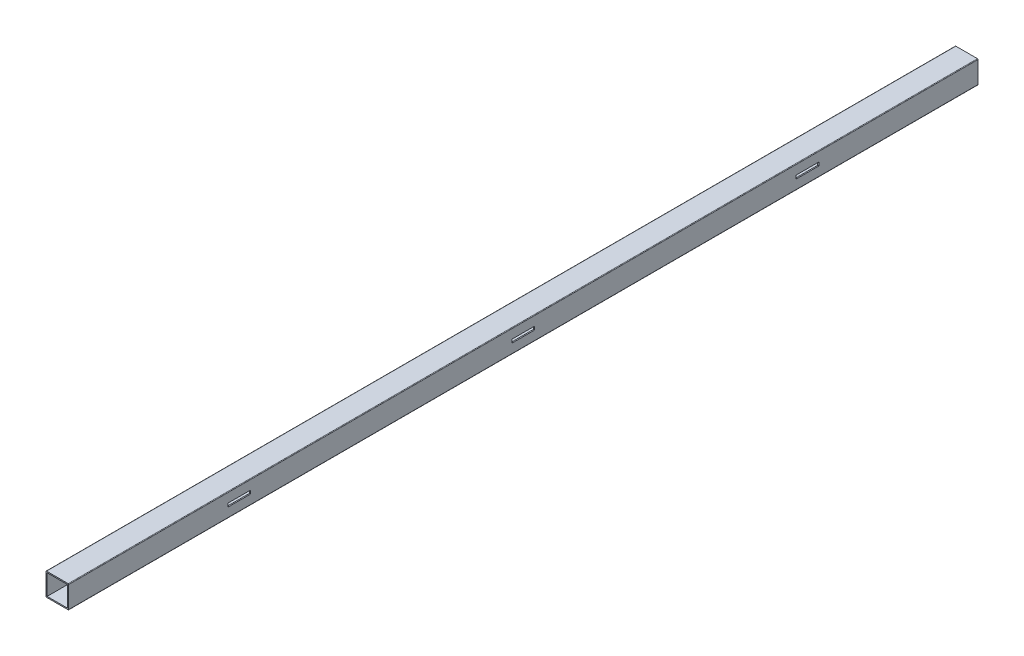
ISO-10303-21;
HEADER;
FILE_DESCRIPTION(('STEP AP214'),'2;1');
FILE_NAME('part.step','',(''),(''),'','','');
FILE_SCHEMA(('AUTOMOTIVE_DESIGN { 1 0 10303 214 1 1 1 1 }'));
ENDSEC;
DATA;
#1=APPLICATION_CONTEXT('core data for automotive mechanical design processes');
#2=APPLICATION_PROTOCOL_DEFINITION('international standard','automotive_design',2000,#1);
#3=PRODUCT_CONTEXT('',#1,'mechanical');
#4=PRODUCT('Part','Part','',(#3));
#5=PRODUCT_RELATED_PRODUCT_CATEGORY('part','',(#4));
#6=PRODUCT_DEFINITION_FORMATION('','',#4);
#7=PRODUCT_DEFINITION_CONTEXT('part definition',#1,'design');
#8=PRODUCT_DEFINITION('design','',#6,#7);
#9=PRODUCT_DEFINITION_SHAPE('','',#8);
#10=(LENGTH_UNIT() NAMED_UNIT(*) SI_UNIT(.MILLI.,.METRE.));
#11=(NAMED_UNIT(*) PLANE_ANGLE_UNIT() SI_UNIT($,.RADIAN.));
#12=(NAMED_UNIT(*) SI_UNIT($,.STERADIAN.) SOLID_ANGLE_UNIT());
#13=UNCERTAINTY_MEASURE_WITH_UNIT(LENGTH_MEASURE(1.E-05),#10,'distance_accuracy_value','');
#14=(GEOMETRIC_REPRESENTATION_CONTEXT(3) GLOBAL_UNCERTAINTY_ASSIGNED_CONTEXT((#13)) GLOBAL_UNIT_ASSIGNED_CONTEXT((#10,
#11,#12)) REPRESENTATION_CONTEXT('',''));
#15=CARTESIAN_POINT('',(0.,0.,0.));
#16=DIRECTION('',(0.,0.,1.));
#17=DIRECTION('',(1.,0.,0.));
#18=AXIS2_PLACEMENT_3D('',#15,#16,#17);
#19=CARTESIAN_POINT('',(-9.5,-9.5,800.));
#20=DIRECTION('',(0.,0.,1.));
#21=DIRECTION('',(1.,0.,0.));
#22=AXIS2_PLACEMENT_3D('',#19,#20,#21);
#23=PLANE('',#22);
#24=CARTESIAN_POINT('',(-9.5,-9.5,800.));
#25=DIRECTION('',(0.,0.,1.));
#26=DIRECTION('',(-1.,0.,0.));
#27=AXIS2_PLACEMENT_3D('',#24,#25,#26);
#28=CIRCLE('',#27,0.5);
#29=CARTESIAN_POINT('',(-10.,-9.49999999999999,800.));
#30=VERTEX_POINT('',#29);
#31=CARTESIAN_POINT('',(-9.49999999999999,-10.,800.));
#32=VERTEX_POINT('',#31);
#33=EDGE_CURVE('E334',#30,#32,#28,.T.);
#34=ORIENTED_EDGE('',*,*,#33,.T.);
#35=DIRECTION('',(1.,0.,0.));
#36=VECTOR('',#35,1.);
#37=CARTESIAN_POINT('',(-9.49999999999999,-10.,800.));
#38=LINE('',#37,#36);
#39=CARTESIAN_POINT('',(9.5,-10.,800.));
#40=VERTEX_POINT('',#39);
#41=EDGE_CURVE('E337',#32,#40,#38,.T.);
#42=ORIENTED_EDGE('',*,*,#41,.T.);
#43=CARTESIAN_POINT('',(9.5,-9.5,800.));
#44=DIRECTION('',(0.,0.,1.));
#45=DIRECTION('',(1.,0.,0.));
#46=AXIS2_PLACEMENT_3D('',#43,#44,#45);
#47=CIRCLE('',#46,0.5);
#48=CARTESIAN_POINT('',(10.,-9.5,800.));
#49=VERTEX_POINT('',#48);
#50=EDGE_CURVE('E340',#40,#49,#47,.T.);
#51=ORIENTED_EDGE('',*,*,#50,.T.);
#52=DIRECTION('',(0.,1.,0.));
#53=VECTOR('',#52,1.);
#54=CARTESIAN_POINT('',(10.,-9.49999999999999,800.));
#55=LINE('',#54,#53);
#56=CARTESIAN_POINT('',(10.,9.5,800.));
#57=VERTEX_POINT('',#56);
#58=EDGE_CURVE('E342',#49,#57,#55,.T.);
#59=ORIENTED_EDGE('',*,*,#58,.T.);
#60=CARTESIAN_POINT('',(9.5,9.5,800.));
#61=DIRECTION('',(0.,0.,1.));
#62=DIRECTION('',(-1.,0.,0.));
#63=AXIS2_PLACEMENT_3D('',#60,#61,#62);
#64=CIRCLE('',#63,0.5);
#65=CARTESIAN_POINT('',(9.5,10.,800.));
#66=VERTEX_POINT('',#65);
#67=EDGE_CURVE('E344',#57,#66,#64,.T.);
#68=ORIENTED_EDGE('',*,*,#67,.T.);
#69=DIRECTION('',(-1.,0.,0.));
#70=VECTOR('',#69,1.);
#71=CARTESIAN_POINT('',(-9.49999999999999,10.,800.));
#72=LINE('',#71,#70);
#73=CARTESIAN_POINT('',(-9.49999999999999,10.,800.));
#74=VERTEX_POINT('',#73);
#75=EDGE_CURVE('E346',#66,#74,#72,.T.);
#76=ORIENTED_EDGE('',*,*,#75,.T.);
#77=CARTESIAN_POINT('',(-9.5,9.5,800.));
#78=DIRECTION('',(0.,0.,1.));
#79=DIRECTION('',(-1.,0.,0.));
#80=AXIS2_PLACEMENT_3D('',#77,#78,#79);
#81=CIRCLE('',#80,0.5);
#82=CARTESIAN_POINT('',(-10.,9.5,800.));
#83=VERTEX_POINT('',#82);
#84=EDGE_CURVE('E348',#74,#83,#81,.T.);
#85=ORIENTED_EDGE('',*,*,#84,.T.);
#86=DIRECTION('',(0.,-1.,0.));
#87=VECTOR('',#86,1.);
#88=CARTESIAN_POINT('',(-10.,-9.49999999999999,800.));
#89=LINE('',#88,#87);
#90=EDGE_CURVE('E350',#83,#30,#89,.T.);
#91=ORIENTED_EDGE('',*,*,#90,.T.);
#92=EDGE_LOOP('',(#34,#42,#51,#59,#68,#76,#85,#91));
#93=FACE_BOUND('',#92,.T.);
#94=DIRECTION('',(1.,0.,0.));
#95=VECTOR('',#94,1.);
#96=CARTESIAN_POINT('',(-9.5,-9.,800.));
#97=LINE('',#96,#95);
#98=CARTESIAN_POINT('',(-9.,-9.,800.));
#99=VERTEX_POINT('',#98);
#100=CARTESIAN_POINT('',(9.,-9.,800.));
#101=VERTEX_POINT('',#100);
#102=EDGE_CURVE('E305',#99,#101,#97,.T.);
#103=ORIENTED_EDGE('',*,*,#102,.F.);
#104=DIRECTION('',(0.,-1.,0.));
#105=VECTOR('',#104,1.);
#106=CARTESIAN_POINT('',(-9.,-9.5,800.));
#107=LINE('',#106,#105);
#108=CARTESIAN_POINT('',(-9.,9.,800.));
#109=VERTEX_POINT('',#108);
#110=EDGE_CURVE('E303',#109,#99,#107,.T.);
#111=ORIENTED_EDGE('',*,*,#110,.F.);
#112=DIRECTION('',(-1.,0.,0.));
#113=VECTOR('',#112,1.);
#114=CARTESIAN_POINT('',(-9.5,9.,800.));
#115=LINE('',#114,#113);
#116=CARTESIAN_POINT('',(9.,9.,800.));
#117=VERTEX_POINT('',#116);
#118=EDGE_CURVE('E311',#117,#109,#115,.T.);
#119=ORIENTED_EDGE('',*,*,#118,.F.);
#120=DIRECTION('',(0.,1.,0.));
#121=VECTOR('',#120,1.);
#122=CARTESIAN_POINT('',(9.,-9.5,800.));
#123=LINE('',#122,#121);
#124=EDGE_CURVE('E308',#101,#117,#123,.T.);
#125=ORIENTED_EDGE('',*,*,#124,.F.);
#126=EDGE_LOOP('',(#103,#111,#119,#125));
#127=FACE_BOUND('',#126,.T.);
#128=ADVANCED_FACE('F69',(#93,#127),#23,.T.);
#129=CARTESIAN_POINT('',(-9.5,-9.5,0.));
#130=DIRECTION('',(0.,0.,1.));
#131=DIRECTION('',(1.,0.,0.));
#132=AXIS2_PLACEMENT_3D('',#129,#130,#131);
#133=PLANE('',#132);
#134=CARTESIAN_POINT('',(-9.5,-9.5,0.));
#135=DIRECTION('',(0.,0.,1.));
#136=DIRECTION('',(-1.,0.,0.));
#137=AXIS2_PLACEMENT_3D('',#134,#135,#136);
#138=CIRCLE('',#137,0.5);
#139=CARTESIAN_POINT('',(-10.,-9.49999999999999,0.));
#140=VERTEX_POINT('',#139);
#141=CARTESIAN_POINT('',(-9.49999999999999,-10.,0.));
#142=VERTEX_POINT('',#141);
#143=EDGE_CURVE('E333',#140,#142,#138,.T.);
#144=ORIENTED_EDGE('',*,*,#143,.F.);
#145=DIRECTION('',(0.,-1.,0.));
#146=VECTOR('',#145,1.);
#147=CARTESIAN_POINT('',(-10.,-9.49999999999999,0.));
#148=LINE('',#147,#146);
#149=CARTESIAN_POINT('',(-10.,9.5,0.));
#150=VERTEX_POINT('',#149);
#151=EDGE_CURVE('E338',#150,#140,#148,.T.);
#152=ORIENTED_EDGE('',*,*,#151,.F.);
#153=CARTESIAN_POINT('',(-9.5,9.5,0.));
#154=DIRECTION('',(0.,0.,1.));
#155=DIRECTION('',(-1.,0.,0.));
#156=AXIS2_PLACEMENT_3D('',#153,#154,#155);
#157=CIRCLE('',#156,0.5);
#158=CARTESIAN_POINT('',(-9.49999999999999,10.,0.));
#159=VERTEX_POINT('',#158);
#160=EDGE_CURVE('E365',#159,#150,#157,.T.);
#161=ORIENTED_EDGE('',*,*,#160,.F.);
#162=DIRECTION('',(-1.,0.,0.));
#163=VECTOR('',#162,1.);
#164=CARTESIAN_POINT('',(-9.49999999999999,10.,0.));
#165=LINE('',#164,#163);
#166=CARTESIAN_POINT('',(9.5,10.,0.));
#167=VERTEX_POINT('',#166);
#168=EDGE_CURVE('E363',#167,#159,#165,.T.);
#169=ORIENTED_EDGE('',*,*,#168,.F.);
#170=CARTESIAN_POINT('',(9.5,9.5,0.));
#171=DIRECTION('',(0.,0.,1.));
#172=DIRECTION('',(-1.,0.,0.));
#173=AXIS2_PLACEMENT_3D('',#170,#171,#172);
#174=CIRCLE('',#173,0.5);
#175=CARTESIAN_POINT('',(10.,9.5,0.));
#176=VERTEX_POINT('',#175);
#177=EDGE_CURVE('E361',#176,#167,#174,.T.);
#178=ORIENTED_EDGE('',*,*,#177,.F.);
#179=DIRECTION('',(0.,1.,0.));
#180=VECTOR('',#179,1.);
#181=CARTESIAN_POINT('',(10.,-9.49999999999999,0.));
#182=LINE('',#181,#180);
#183=CARTESIAN_POINT('',(10.,-9.5,0.));
#184=VERTEX_POINT('',#183);
#185=EDGE_CURVE('E359',#184,#176,#182,.T.);
#186=ORIENTED_EDGE('',*,*,#185,.F.);
#187=CARTESIAN_POINT('',(9.5,-9.5,0.));
#188=DIRECTION('',(0.,0.,1.));
#189=DIRECTION('',(1.,0.,0.));
#190=AXIS2_PLACEMENT_3D('',#187,#188,#189);
#191=CIRCLE('',#190,0.5);
#192=CARTESIAN_POINT('',(9.5,-10.,0.));
#193=VERTEX_POINT('',#192);
#194=EDGE_CURVE('E357',#193,#184,#191,.T.);
#195=ORIENTED_EDGE('',*,*,#194,.F.);
#196=DIRECTION('',(1.,0.,0.));
#197=VECTOR('',#196,1.);
#198=CARTESIAN_POINT('',(-9.49999999999999,-10.,0.));
#199=LINE('',#198,#197);
#200=EDGE_CURVE('E355',#142,#193,#199,.T.);
#201=ORIENTED_EDGE('',*,*,#200,.F.);
#202=EDGE_LOOP('',(#144,#152,#161,#169,#178,#186,#195,#201));
#203=FACE_BOUND('',#202,.T.);
#204=DIRECTION('',(0.,-1.,0.));
#205=VECTOR('',#204,1.);
#206=CARTESIAN_POINT('',(-9.,-9.5,0.));
#207=LINE('',#206,#205);
#208=CARTESIAN_POINT('',(-9.,9.,0.));
#209=VERTEX_POINT('',#208);
#210=CARTESIAN_POINT('',(-9.,-9.,0.));
#211=VERTEX_POINT('',#210);
#212=EDGE_CURVE('E262',#209,#211,#207,.T.);
#213=ORIENTED_EDGE('',*,*,#212,.T.);
#214=DIRECTION('',(1.,0.,0.));
#215=VECTOR('',#214,1.);
#216=CARTESIAN_POINT('',(-9.5,-9.,0.));
#217=LINE('',#216,#215);
#218=CARTESIAN_POINT('',(9.,-9.,0.));
#219=VERTEX_POINT('',#218);
#220=EDGE_CURVE('E316',#211,#219,#217,.T.);
#221=ORIENTED_EDGE('',*,*,#220,.T.);
#222=DIRECTION('',(0.,1.,0.));
#223=VECTOR('',#222,1.);
#224=CARTESIAN_POINT('',(9.,-9.5,0.));
#225=LINE('',#224,#223);
#226=CARTESIAN_POINT('',(9.,9.,0.));
#227=VERTEX_POINT('',#226);
#228=EDGE_CURVE('E319',#219,#227,#225,.T.);
#229=ORIENTED_EDGE('',*,*,#228,.T.);
#230=DIRECTION('',(-1.,0.,0.));
#231=VECTOR('',#230,1.);
#232=CARTESIAN_POINT('',(-9.5,9.,0.));
#233=LINE('',#232,#231);
#234=EDGE_CURVE('E306',#227,#209,#233,.T.);
#235=ORIENTED_EDGE('',*,*,#234,.T.);
#236=EDGE_LOOP('',(#213,#221,#229,#235));
#237=FACE_BOUND('',#236,.T.);
#238=ADVANCED_FACE('F448',(#203,#237),#133,.F.);
#239=CARTESIAN_POINT('',(-9.5,-9.5,800.));
#240=DIRECTION('',(0.,0.,-1.));
#241=DIRECTION('',(-1.,0.,0.));
#242=AXIS2_PLACEMENT_3D('',#239,#240,#241);
#243=CYLINDRICAL_SURFACE('',#242,0.5);
#244=ORIENTED_EDGE('',*,*,#143,.T.);
#245=DIRECTION('',(0.,0.,-1.));
#246=VECTOR('',#245,1.);
#247=CARTESIAN_POINT('',(-9.49999999999999,-10.,800.));
#248=LINE('',#247,#246);
#249=EDGE_CURVE('E388',#32,#142,#248,.T.);
#250=ORIENTED_EDGE('',*,*,#249,.F.);
#251=ORIENTED_EDGE('',*,*,#33,.F.);
#252=DIRECTION('',(0.,0.,-1.));
#253=VECTOR('',#252,1.);
#254=CARTESIAN_POINT('',(-10.,-9.49999999999999,800.));
#255=LINE('',#254,#253);
#256=EDGE_CURVE('E352',#30,#140,#255,.T.);
#257=ORIENTED_EDGE('',*,*,#256,.T.);
#258=EDGE_LOOP('',(#244,#250,#251,#257));
#259=FACE_BOUND('',#258,.T.);
#260=ADVANCED_FACE('F71',(#259),#243,.T.);
#261=CARTESIAN_POINT('',(-9.49999999999999,-10.,800.));
#262=DIRECTION('',(0.,1.,0.));
#263=DIRECTION('',(0.,0.,1.));
#264=AXIS2_PLACEMENT_3D('',#261,#262,#263);
#265=PLANE('',#264);
#266=CARTESIAN_POINT('',(0.,-10.,25.));
#267=DIRECTION('',(0.,-1.,0.));
#268=DIRECTION('',(0.,0.,-1.));
#269=AXIS2_PLACEMENT_3D('',#266,#267,#268);
#270=CIRCLE('',#269,2.5);
#271=CARTESIAN_POINT('',(0.,-10.,22.5));
#272=VERTEX_POINT('',#271);
#273=EDGE_CURVE('E417',#272,#272,#270,.T.);
#274=ORIENTED_EDGE('',*,*,#273,.F.);
#275=EDGE_LOOP('',(#274));
#276=FACE_BOUND('',#275,.T.);
#277=CARTESIAN_POINT('',(-8.57562249721442E-13,-10.,275.));
#278=DIRECTION('',(0.,-1.,0.));
#279=DIRECTION('',(0.,0.,-1.));
#280=AXIS2_PLACEMENT_3D('',#277,#278,#279);
#281=CIRCLE('',#280,2.5);
#282=CARTESIAN_POINT('',(-8.57562249721442E-13,-10.,272.5));
#283=VERTEX_POINT('',#282);
#284=EDGE_CURVE('E510',#283,#283,#281,.T.);
#285=ORIENTED_EDGE('',*,*,#284,.F.);
#286=EDGE_LOOP('',(#285));
#287=FACE_BOUND('',#286,.T.);
#288=CARTESIAN_POINT('',(-1.71512449944288E-12,-10.,525.));
#289=DIRECTION('',(0.,-1.,0.));
#290=DIRECTION('',(0.,0.,-1.));
#291=AXIS2_PLACEMENT_3D('',#288,#289,#290);
#292=CIRCLE('',#291,2.5);
#293=CARTESIAN_POINT('',(-1.71512449944288E-12,-10.,522.5));
#294=VERTEX_POINT('',#293);
#295=EDGE_CURVE('E514',#294,#294,#292,.T.);
#296=ORIENTED_EDGE('',*,*,#295,.F.);
#297=EDGE_LOOP('',(#296));
#298=FACE_BOUND('',#297,.T.);
#299=CARTESIAN_POINT('',(-1.33779710956545E-12,-10.,775.));
#300=DIRECTION('',(0.,-1.,0.));
#301=DIRECTION('',(0.,0.,-1.));
#302=AXIS2_PLACEMENT_3D('',#299,#300,#301);
#303=CIRCLE('',#302,2.5);
#304=CARTESIAN_POINT('',(-1.33779710956545E-12,-10.,772.5));
#305=VERTEX_POINT('',#304);
#306=EDGE_CURVE('E518',#305,#305,#303,.T.);
#307=ORIENTED_EDGE('',*,*,#306,.F.);
#308=EDGE_LOOP('',(#307));
#309=FACE_BOUND('',#308,.T.);
#310=ORIENTED_EDGE('',*,*,#200,.T.);
#311=DIRECTION('',(0.,0.,-1.));
#312=VECTOR('',#311,1.);
#313=CARTESIAN_POINT('',(9.5,-10.,800.));
#314=LINE('',#313,#312);
#315=EDGE_CURVE('E385',#40,#193,#314,.T.);
#316=ORIENTED_EDGE('',*,*,#315,.F.);
#317=ORIENTED_EDGE('',*,*,#41,.F.);
#318=ORIENTED_EDGE('',*,*,#249,.T.);
#319=EDGE_LOOP('',(#310,#316,#317,#318));
#320=FACE_BOUND('',#319,.T.);
#321=ADVANCED_FACE('F496',(#276,#287,#298,#309,#320),#265,.F.);
#322=CARTESIAN_POINT('',(9.5,-9.5,800.));
#323=DIRECTION('',(0.,0.,-1.));
#324=DIRECTION('',(-1.,0.,0.));
#325=AXIS2_PLACEMENT_3D('',#322,#323,#324);
#326=CYLINDRICAL_SURFACE('',#325,0.5);
#327=ORIENTED_EDGE('',*,*,#194,.T.);
#328=DIRECTION('',(0.,0.,-1.));
#329=VECTOR('',#328,1.);
#330=CARTESIAN_POINT('',(10.,-9.5,800.));
#331=LINE('',#330,#329);
#332=EDGE_CURVE('E382',#49,#184,#331,.T.);
#333=ORIENTED_EDGE('',*,*,#332,.F.);
#334=ORIENTED_EDGE('',*,*,#50,.F.);
#335=ORIENTED_EDGE('',*,*,#315,.T.);
#336=EDGE_LOOP('',(#327,#333,#334,#335));
#337=FACE_BOUND('',#336,.T.);
#338=ADVANCED_FACE('F494',(#337),#326,.T.);
#339=CARTESIAN_POINT('',(10.,-9.49999999999999,800.));
#340=DIRECTION('',(-1.,0.,0.));
#341=DIRECTION('',(0.,0.,1.));
#342=AXIS2_PLACEMENT_3D('',#339,#340,#341);
#343=PLANE('',#342);
#344=DIRECTION('',(0.,0.,-1.));
#345=VECTOR('',#344,1.);
#346=CARTESIAN_POINT('',(10.,-1.5,140.));
#347=LINE('',#346,#345);
#348=CARTESIAN_POINT('',(10.,-1.5,160.));
#349=VERTEX_POINT('',#348);
#350=CARTESIAN_POINT('',(10.,-1.5,140.));
#351=VERTEX_POINT('',#350);
#352=EDGE_CURVE('E248',#349,#351,#347,.T.);
#353=ORIENTED_EDGE('',*,*,#352,.F.);
#354=DIRECTION('',(0.,-1.,0.));
#355=VECTOR('',#354,1.);
#356=CARTESIAN_POINT('',(10.,-1.5,160.));
#357=LINE('',#356,#355);
#358=CARTESIAN_POINT('',(10.,1.5,160.));
#359=VERTEX_POINT('',#358);
#360=EDGE_CURVE('E86',#359,#349,#357,.T.);
#361=ORIENTED_EDGE('',*,*,#360,.F.);
#362=DIRECTION('',(0.,0.,1.));
#363=VECTOR('',#362,1.);
#364=CARTESIAN_POINT('',(10.,1.5,140.));
#365=LINE('',#364,#363);
#366=CARTESIAN_POINT('',(10.,1.5,140.));
#367=VERTEX_POINT('',#366);
#368=EDGE_CURVE('E255',#367,#359,#365,.T.);
#369=ORIENTED_EDGE('',*,*,#368,.F.);
#370=DIRECTION('',(0.,1.,0.));
#371=VECTOR('',#370,1.);
#372=CARTESIAN_POINT('',(10.,-1.5,140.));
#373=LINE('',#372,#371);
#374=EDGE_CURVE('E238',#351,#367,#373,.T.);
#375=ORIENTED_EDGE('',*,*,#374,.F.);
#376=EDGE_LOOP('',(#353,#361,#369,#375));
#377=FACE_BOUND('',#376,.T.);
#378=DIRECTION('',(0.,-1.,0.));
#379=VECTOR('',#378,1.);
#380=CARTESIAN_POINT('',(10.,-1.50000000000175,410.));
#381=LINE('',#380,#379);
#382=CARTESIAN_POINT('',(10.,1.49999999999825,410.));
#383=VERTEX_POINT('',#382);
#384=CARTESIAN_POINT('',(10.,-1.50000000000175,410.));
#385=VERTEX_POINT('',#384);
#386=EDGE_CURVE('E266',#383,#385,#381,.T.);
#387=ORIENTED_EDGE('',*,*,#386,.F.);
#388=DIRECTION('',(0.,0.,1.));
#389=VECTOR('',#388,1.);
#390=CARTESIAN_POINT('',(10.,1.49999999999826,390.));
#391=LINE('',#390,#389);
#392=CARTESIAN_POINT('',(10.,1.49999999999826,390.));
#393=VERTEX_POINT('',#392);
#394=EDGE_CURVE('E94',#393,#383,#391,.T.);
#395=ORIENTED_EDGE('',*,*,#394,.F.);
#396=DIRECTION('',(0.,1.,0.));
#397=VECTOR('',#396,1.);
#398=CARTESIAN_POINT('',(10.,-1.50000000000174,390.));
#399=LINE('',#398,#397);
#400=CARTESIAN_POINT('',(10.,-1.50000000000174,390.));
#401=VERTEX_POINT('',#400);
#402=EDGE_CURVE('E273',#401,#393,#399,.T.);
#403=ORIENTED_EDGE('',*,*,#402,.F.);
#404=DIRECTION('',(0.,0.,-1.));
#405=VECTOR('',#404,1.);
#406=CARTESIAN_POINT('',(10.,-1.50000000000174,390.));
#407=LINE('',#406,#405);
#408=EDGE_CURVE('E270',#385,#401,#407,.T.);
#409=ORIENTED_EDGE('',*,*,#408,.F.);
#410=EDGE_LOOP('',(#387,#395,#403,#409));
#411=FACE_BOUND('',#410,.T.);
#412=DIRECTION('',(0.,-1.,0.));
#413=VECTOR('',#412,1.);
#414=CARTESIAN_POINT('',(10.,-1.50000000000342,660.));
#415=LINE('',#414,#413);
#416=CARTESIAN_POINT('',(10.,1.49999999999658,660.));
#417=VERTEX_POINT('',#416);
#418=CARTESIAN_POINT('',(10.,-1.50000000000342,660.));
#419=VERTEX_POINT('',#418);
#420=EDGE_CURVE('E286',#417,#419,#415,.T.);
#421=ORIENTED_EDGE('',*,*,#420,.F.);
#422=DIRECTION('',(0.,0.,1.));
#423=VECTOR('',#422,1.);
#424=CARTESIAN_POINT('',(10.,1.49999999999651,640.));
#425=LINE('',#424,#423);
#426=CARTESIAN_POINT('',(10.,1.49999999999651,640.));
#427=VERTEX_POINT('',#426);
#428=EDGE_CURVE('E284',#427,#417,#425,.T.);
#429=ORIENTED_EDGE('',*,*,#428,.F.);
#430=DIRECTION('',(0.,1.,0.));
#431=VECTOR('',#430,1.);
#432=CARTESIAN_POINT('',(10.,-1.50000000000349,640.));
#433=LINE('',#432,#431);
#434=CARTESIAN_POINT('',(10.,-1.50000000000349,640.));
#435=VERTEX_POINT('',#434);
#436=EDGE_CURVE('E292',#435,#427,#433,.T.);
#437=ORIENTED_EDGE('',*,*,#436,.F.);
#438=DIRECTION('',(0.,0.,-1.));
#439=VECTOR('',#438,1.);
#440=CARTESIAN_POINT('',(10.,-1.50000000000349,640.));
#441=LINE('',#440,#439);
#442=EDGE_CURVE('E289',#419,#435,#441,.T.);
#443=ORIENTED_EDGE('',*,*,#442,.F.);
#444=EDGE_LOOP('',(#421,#429,#437,#443));
#445=FACE_BOUND('',#444,.T.);
#446=ORIENTED_EDGE('',*,*,#185,.T.);
#447=DIRECTION('',(0.,0.,-1.));
#448=VECTOR('',#447,1.);
#449=CARTESIAN_POINT('',(10.,9.5,800.));
#450=LINE('',#449,#448);
#451=EDGE_CURVE('E379',#57,#176,#450,.T.);
#452=ORIENTED_EDGE('',*,*,#451,.F.);
#453=ORIENTED_EDGE('',*,*,#58,.F.);
#454=ORIENTED_EDGE('',*,*,#332,.T.);
#455=EDGE_LOOP('',(#446,#452,#453,#454));
#456=FACE_BOUND('',#455,.T.);
#457=ADVANCED_FACE('F252',(#377,#411,#445,#456),#343,.F.);
#458=CARTESIAN_POINT('',(9.5,9.5,800.));
#459=DIRECTION('',(0.,0.,-1.));
#460=DIRECTION('',(-1.,0.,0.));
#461=AXIS2_PLACEMENT_3D('',#458,#459,#460);
#462=CYLINDRICAL_SURFACE('',#461,0.5);
#463=ORIENTED_EDGE('',*,*,#177,.T.);
#464=DIRECTION('',(0.,0.,-1.));
#465=VECTOR('',#464,1.);
#466=CARTESIAN_POINT('',(9.5,10.,800.));
#467=LINE('',#466,#465);
#468=EDGE_CURVE('E376',#66,#167,#467,.T.);
#469=ORIENTED_EDGE('',*,*,#468,.F.);
#470=ORIENTED_EDGE('',*,*,#67,.F.);
#471=ORIENTED_EDGE('',*,*,#451,.T.);
#472=EDGE_LOOP('',(#463,#469,#470,#471));
#473=FACE_BOUND('',#472,.T.);
#474=ADVANCED_FACE('F487',(#473),#462,.T.);
#475=CARTESIAN_POINT('',(-9.49999999999999,10.,800.));
#476=DIRECTION('',(0.,-1.,0.));
#477=DIRECTION('',(0.,0.,-1.));
#478=AXIS2_PLACEMENT_3D('',#475,#476,#477);
#479=PLANE('',#478);
#480=ORIENTED_EDGE('',*,*,#168,.T.);
#481=DIRECTION('',(0.,0.,-1.));
#482=VECTOR('',#481,1.);
#483=CARTESIAN_POINT('',(-9.49999999999999,10.,800.));
#484=LINE('',#483,#482);
#485=EDGE_CURVE('E373',#74,#159,#484,.T.);
#486=ORIENTED_EDGE('',*,*,#485,.F.);
#487=ORIENTED_EDGE('',*,*,#75,.F.);
#488=ORIENTED_EDGE('',*,*,#468,.T.);
#489=EDGE_LOOP('',(#480,#486,#487,#488));
#490=FACE_BOUND('',#489,.T.);
#491=ADVANCED_FACE('F483',(#490),#479,.F.);
#492=CARTESIAN_POINT('',(-9.5,9.5,800.));
#493=DIRECTION('',(0.,0.,-1.));
#494=DIRECTION('',(-1.,0.,0.));
#495=AXIS2_PLACEMENT_3D('',#492,#493,#494);
#496=CYLINDRICAL_SURFACE('',#495,0.5);
#497=ORIENTED_EDGE('',*,*,#160,.T.);
#498=DIRECTION('',(0.,0.,-1.));
#499=VECTOR('',#498,1.);
#500=CARTESIAN_POINT('',(-10.,9.5,800.));
#501=LINE('',#500,#499);
#502=EDGE_CURVE('E370',#83,#150,#501,.T.);
#503=ORIENTED_EDGE('',*,*,#502,.F.);
#504=ORIENTED_EDGE('',*,*,#84,.F.);
#505=ORIENTED_EDGE('',*,*,#485,.T.);
#506=EDGE_LOOP('',(#497,#503,#504,#505));
#507=FACE_BOUND('',#506,.T.);
#508=ADVANCED_FACE('F479',(#507),#496,.T.);
#509=CARTESIAN_POINT('',(-10.,-9.49999999999999,800.));
#510=DIRECTION('',(1.,0.,0.));
#511=DIRECTION('',(0.,0.,-1.));
#512=AXIS2_PLACEMENT_3D('',#509,#510,#511);
#513=PLANE('',#512);
#514=ORIENTED_EDGE('',*,*,#151,.T.);
#515=ORIENTED_EDGE('',*,*,#256,.F.);
#516=ORIENTED_EDGE('',*,*,#90,.F.);
#517=ORIENTED_EDGE('',*,*,#502,.T.);
#518=EDGE_LOOP('',(#514,#515,#516,#517));
#519=FACE_BOUND('',#518,.T.);
#520=ADVANCED_FACE('F476',(#519),#513,.F.);
#521=CARTESIAN_POINT('',(-9.,-9.5,800.));
#522=DIRECTION('',(1.,0.,0.));
#523=DIRECTION('',(0.,0.,-1.));
#524=AXIS2_PLACEMENT_3D('',#521,#522,#523);
#525=PLANE('',#524);
#526=ORIENTED_EDGE('',*,*,#212,.F.);
#527=DIRECTION('',(0.,0.,-1.));
#528=VECTOR('',#527,1.);
#529=CARTESIAN_POINT('',(-9.,9.,800.));
#530=LINE('',#529,#528);
#531=EDGE_CURVE('E313',#109,#209,#530,.T.);
#532=ORIENTED_EDGE('',*,*,#531,.F.);
#533=ORIENTED_EDGE('',*,*,#110,.T.);
#534=DIRECTION('',(0.,0.,-1.));
#535=VECTOR('',#534,1.);
#536=CARTESIAN_POINT('',(-9.,-9.,800.));
#537=LINE('',#536,#535);
#538=EDGE_CURVE('E330',#99,#211,#537,.T.);
#539=ORIENTED_EDGE('',*,*,#538,.T.);
#540=EDGE_LOOP('',(#526,#532,#533,#539));
#541=FACE_BOUND('',#540,.T.);
#542=ADVANCED_FACE('F433',(#541),#525,.T.);
#543=CARTESIAN_POINT('',(-9.5,-9.,800.));
#544=DIRECTION('',(0.,1.,0.));
#545=DIRECTION('',(0.,0.,1.));
#546=AXIS2_PLACEMENT_3D('',#543,#544,#545);
#547=PLANE('',#546);
#548=CARTESIAN_POINT('',(0.,-9.,25.));
#549=DIRECTION('',(0.,1.,0.));
#550=DIRECTION('',(0.,0.,1.));
#551=AXIS2_PLACEMENT_3D('',#548,#549,#550);
#552=CIRCLE('',#551,2.5);
#553=CARTESIAN_POINT('',(0.,-9.,27.5));
#554=VERTEX_POINT('',#553);
#555=EDGE_CURVE('E73',#554,#554,#552,.T.);
#556=ORIENTED_EDGE('',*,*,#555,.F.);
#557=EDGE_LOOP('',(#556));
#558=FACE_BOUND('',#557,.T.);
#559=CARTESIAN_POINT('',(-8.57562249721442E-13,-9.,275.));
#560=DIRECTION('',(0.,1.,0.));
#561=DIRECTION('',(0.,0.,1.));
#562=AXIS2_PLACEMENT_3D('',#559,#560,#561);
#563=CIRCLE('',#562,2.5);
#564=CARTESIAN_POINT('',(-8.57562249721442E-13,-9.,277.5));
#565=VERTEX_POINT('',#564);
#566=EDGE_CURVE('E419',#565,#565,#563,.T.);
#567=ORIENTED_EDGE('',*,*,#566,.F.);
#568=EDGE_LOOP('',(#567));
#569=FACE_BOUND('',#568,.T.);
#570=CARTESIAN_POINT('',(-1.71512449944288E-12,-9.,525.));
#571=DIRECTION('',(0.,1.,0.));
#572=DIRECTION('',(0.,0.,1.));
#573=AXIS2_PLACEMENT_3D('',#570,#571,#572);
#574=CIRCLE('',#573,2.5);
#575=CARTESIAN_POINT('',(-1.71512449944288E-12,-9.,527.5));
#576=VERTEX_POINT('',#575);
#577=EDGE_CURVE('E416',#576,#576,#574,.T.);
#578=ORIENTED_EDGE('',*,*,#577,.F.);
#579=EDGE_LOOP('',(#578));
#580=FACE_BOUND('',#579,.T.);
#581=CARTESIAN_POINT('',(-1.33779710956545E-12,-9.,775.));
#582=DIRECTION('',(0.,1.,0.));
#583=DIRECTION('',(0.,0.,1.));
#584=AXIS2_PLACEMENT_3D('',#581,#582,#583);
#585=CIRCLE('',#584,2.5);
#586=CARTESIAN_POINT('',(-1.33779710956545E-12,-9.,777.5));
#587=VERTEX_POINT('',#586);
#588=EDGE_CURVE('E413',#587,#587,#585,.T.);
#589=ORIENTED_EDGE('',*,*,#588,.F.);
#590=EDGE_LOOP('',(#589));
#591=FACE_BOUND('',#590,.T.);
#592=ORIENTED_EDGE('',*,*,#220,.F.);
#593=ORIENTED_EDGE('',*,*,#538,.F.);
#594=ORIENTED_EDGE('',*,*,#102,.T.);
#595=DIRECTION('',(0.,0.,-1.));
#596=VECTOR('',#595,1.);
#597=CARTESIAN_POINT('',(9.,-9.,800.));
#598=LINE('',#597,#596);
#599=EDGE_CURVE('E328',#101,#219,#598,.T.);
#600=ORIENTED_EDGE('',*,*,#599,.T.);
#601=EDGE_LOOP('',(#592,#593,#594,#600));
#602=FACE_BOUND('',#601,.T.);
#603=ADVANCED_FACE('F429',(#558,#569,#580,#591,#602),#547,.T.);
#604=CARTESIAN_POINT('',(9.,-9.5,800.));
#605=DIRECTION('',(-1.,0.,0.));
#606=DIRECTION('',(0.,0.,1.));
#607=AXIS2_PLACEMENT_3D('',#604,#605,#606);
#608=PLANE('',#607);
#609=DIRECTION('',(0.,1.,0.));
#610=VECTOR('',#609,1.);
#611=CARTESIAN_POINT('',(9.,-9.5,160.));
#612=LINE('',#611,#610);
#613=CARTESIAN_POINT('',(9.,-1.5,160.));
#614=VERTEX_POINT('',#613);
#615=CARTESIAN_POINT('',(9.,1.5,160.));
#616=VERTEX_POINT('',#615);
#617=EDGE_CURVE('E12',#614,#616,#612,.T.);
#618=ORIENTED_EDGE('',*,*,#617,.F.);
#619=DIRECTION('',(0.,0.,1.));
#620=VECTOR('',#619,1.);
#621=CARTESIAN_POINT('',(9.,-1.50000000000011,800.));
#622=LINE('',#621,#620);
#623=CARTESIAN_POINT('',(9.,-1.5,140.));
#624=VERTEX_POINT('',#623);
#625=EDGE_CURVE('E409',#624,#614,#622,.T.);
#626=ORIENTED_EDGE('',*,*,#625,.F.);
#627=DIRECTION('',(0.,-1.,0.));
#628=VECTOR('',#627,1.);
#629=CARTESIAN_POINT('',(9.,-9.5,140.));
#630=LINE('',#629,#628);
#631=CARTESIAN_POINT('',(9.,1.5,140.));
#632=VERTEX_POINT('',#631);
#633=EDGE_CURVE('E241',#632,#624,#630,.T.);
#634=ORIENTED_EDGE('',*,*,#633,.F.);
#635=DIRECTION('',(0.,0.,-1.));
#636=VECTOR('',#635,1.);
#637=CARTESIAN_POINT('',(9.,1.49999999999989,800.));
#638=LINE('',#637,#636);
#639=EDGE_CURVE('E78',#616,#632,#638,.T.);
#640=ORIENTED_EDGE('',*,*,#639,.F.);
#641=EDGE_LOOP('',(#618,#626,#634,#640));
#642=FACE_BOUND('',#641,.T.);
#643=DIRECTION('',(0.,0.,-1.));
#644=VECTOR('',#643,1.);
#645=CARTESIAN_POINT('',(9.,1.49999999999821,800.));
#646=LINE('',#645,#644);
#647=CARTESIAN_POINT('',(9.,1.49999999999825,410.));
#648=VERTEX_POINT('',#647);
#649=CARTESIAN_POINT('',(9.,1.49999999999826,390.));
#650=VERTEX_POINT('',#649);
#651=EDGE_CURVE('E407',#648,#650,#646,.T.);
#652=ORIENTED_EDGE('',*,*,#651,.F.);
#653=DIRECTION('',(0.,1.,0.));
#654=VECTOR('',#653,1.);
#655=CARTESIAN_POINT('',(9.,-9.5,410.));
#656=LINE('',#655,#654);
#657=CARTESIAN_POINT('',(9.,-1.50000000000175,410.));
#658=VERTEX_POINT('',#657);
#659=EDGE_CURVE('E400',#658,#648,#656,.T.);
#660=ORIENTED_EDGE('',*,*,#659,.F.);
#661=DIRECTION('',(0.,0.,1.));
#662=VECTOR('',#661,1.);
#663=CARTESIAN_POINT('',(9.,-1.50000000000179,800.));
#664=LINE('',#663,#662);
#665=CARTESIAN_POINT('',(9.,-1.50000000000174,390.));
#666=VERTEX_POINT('',#665);
#667=EDGE_CURVE('E402',#666,#658,#664,.T.);
#668=ORIENTED_EDGE('',*,*,#667,.F.);
#669=DIRECTION('',(0.,-1.,0.));
#670=VECTOR('',#669,1.);
#671=CARTESIAN_POINT('',(9.,-9.5,390.));
#672=LINE('',#671,#670);
#673=EDGE_CURVE('E405',#650,#666,#672,.T.);
#674=ORIENTED_EDGE('',*,*,#673,.F.);
#675=EDGE_LOOP('',(#652,#660,#668,#674));
#676=FACE_BOUND('',#675,.T.);
#677=DIRECTION('',(0.,0.,-1.));
#678=VECTOR('',#677,1.);
#679=CARTESIAN_POINT('',(9.,1.49999999999705,800.));
#680=LINE('',#679,#678);
#681=CARTESIAN_POINT('',(9.,1.49999999999658,660.));
#682=VERTEX_POINT('',#681);
#683=CARTESIAN_POINT('',(9.,1.49999999999651,640.));
#684=VERTEX_POINT('',#683);
#685=EDGE_CURVE('E398',#682,#684,#680,.T.);
#686=ORIENTED_EDGE('',*,*,#685,.F.);
#687=DIRECTION('',(0.,1.,0.));
#688=VECTOR('',#687,1.);
#689=CARTESIAN_POINT('',(9.,-9.5,660.));
#690=LINE('',#689,#688);
#691=CARTESIAN_POINT('',(9.,-1.50000000000342,660.));
#692=VERTEX_POINT('',#691);
#693=EDGE_CURVE('E391',#692,#682,#690,.T.);
#694=ORIENTED_EDGE('',*,*,#693,.F.);
#695=DIRECTION('',(0.,0.,1.));
#696=VECTOR('',#695,1.);
#697=CARTESIAN_POINT('',(9.,-1.50000000000295,800.));
#698=LINE('',#697,#696);
#699=CARTESIAN_POINT('',(9.,-1.50000000000349,640.));
#700=VERTEX_POINT('',#699);
#701=EDGE_CURVE('E393',#700,#692,#698,.T.);
#702=ORIENTED_EDGE('',*,*,#701,.F.);
#703=DIRECTION('',(0.,-1.,0.));
#704=VECTOR('',#703,1.);
#705=CARTESIAN_POINT('',(9.,-9.5,640.));
#706=LINE('',#705,#704);
#707=EDGE_CURVE('E396',#684,#700,#706,.T.);
#708=ORIENTED_EDGE('',*,*,#707,.F.);
#709=EDGE_LOOP('',(#686,#694,#702,#708));
#710=FACE_BOUND('',#709,.T.);
#711=ORIENTED_EDGE('',*,*,#228,.F.);
#712=ORIENTED_EDGE('',*,*,#599,.F.);
#713=ORIENTED_EDGE('',*,*,#124,.T.);
#714=DIRECTION('',(0.,0.,-1.));
#715=VECTOR('',#714,1.);
#716=CARTESIAN_POINT('',(9.,9.,800.));
#717=LINE('',#716,#715);
#718=EDGE_CURVE('E326',#117,#227,#717,.T.);
#719=ORIENTED_EDGE('',*,*,#718,.T.);
#720=EDGE_LOOP('',(#711,#712,#713,#719));
#721=FACE_BOUND('',#720,.T.);
#722=ADVANCED_FACE('F432',(#642,#676,#710,#721),#608,.T.);
#723=CARTESIAN_POINT('',(-9.5,9.,800.));
#724=DIRECTION('',(0.,-1.,0.));
#725=DIRECTION('',(0.,0.,-1.));
#726=AXIS2_PLACEMENT_3D('',#723,#724,#725);
#727=PLANE('',#726);
#728=ORIENTED_EDGE('',*,*,#234,.F.);
#729=ORIENTED_EDGE('',*,*,#718,.F.);
#730=ORIENTED_EDGE('',*,*,#118,.T.);
#731=ORIENTED_EDGE('',*,*,#531,.T.);
#732=EDGE_LOOP('',(#728,#729,#730,#731));
#733=FACE_BOUND('',#732,.T.);
#734=ADVANCED_FACE('F451',(#733),#727,.T.);
#735=CARTESIAN_POINT('',(0.,1.49999999999651,640.));
#736=DIRECTION('',(0.,1.,0.));
#737=DIRECTION('',(0.,0.,1.));
#738=AXIS2_PLACEMENT_3D('',#735,#736,#737);
#739=PLANE('',#738);
#740=ORIENTED_EDGE('',*,*,#685,.T.);
#741=DIRECTION('',(1.,0.,0.));
#742=VECTOR('',#741,1.);
#743=CARTESIAN_POINT('',(0.,1.49999999999651,640.));
#744=LINE('',#743,#742);
#745=EDGE_CURVE('E267',#684,#427,#744,.T.);
#746=ORIENTED_EDGE('',*,*,#745,.T.);
#747=ORIENTED_EDGE('',*,*,#428,.T.);
#748=DIRECTION('',(1.,0.,0.));
#749=VECTOR('',#748,1.);
#750=CARTESIAN_POINT('',(0.,1.49999999999658,660.));
#751=LINE('',#750,#749);
#752=EDGE_CURVE('E295',#682,#417,#751,.T.);
#753=ORIENTED_EDGE('',*,*,#752,.F.);
#754=EDGE_LOOP('',(#740,#746,#747,#753));
#755=FACE_BOUND('',#754,.T.);
#756=ADVANCED_FACE('F462',(#755),#739,.F.);
#757=CARTESIAN_POINT('',(0.,-1.50000000000349,640.));
#758=DIRECTION('',(0.,0.,-1.));
#759=DIRECTION('',(-1.,0.,0.));
#760=AXIS2_PLACEMENT_3D('',#757,#758,#759);
#761=PLANE('',#760);
#762=ORIENTED_EDGE('',*,*,#707,.T.);
#763=DIRECTION('',(1.,0.,0.));
#764=VECTOR('',#763,1.);
#765=CARTESIAN_POINT('',(0.,-1.50000000000349,640.));
#766=LINE('',#765,#764);
#767=EDGE_CURVE('E297',#700,#435,#766,.T.);
#768=ORIENTED_EDGE('',*,*,#767,.T.);
#769=ORIENTED_EDGE('',*,*,#436,.T.);
#770=ORIENTED_EDGE('',*,*,#745,.F.);
#771=EDGE_LOOP('',(#762,#768,#769,#770));
#772=FACE_BOUND('',#771,.T.);
#773=ADVANCED_FACE('F590',(#772),#761,.F.);
#774=CARTESIAN_POINT('',(0.,-1.50000000000349,640.));
#775=DIRECTION('',(0.,-1.,0.));
#776=DIRECTION('',(0.,0.,-1.));
#777=AXIS2_PLACEMENT_3D('',#774,#775,#776);
#778=PLANE('',#777);
#779=ORIENTED_EDGE('',*,*,#701,.T.);
#780=DIRECTION('',(1.,0.,0.));
#781=VECTOR('',#780,1.);
#782=CARTESIAN_POINT('',(0.,-1.50000000000342,660.));
#783=LINE('',#782,#781);
#784=EDGE_CURVE('E299',#692,#419,#783,.T.);
#785=ORIENTED_EDGE('',*,*,#784,.T.);
#786=ORIENTED_EDGE('',*,*,#442,.T.);
#787=ORIENTED_EDGE('',*,*,#767,.F.);
#788=EDGE_LOOP('',(#779,#785,#786,#787));
#789=FACE_BOUND('',#788,.T.);
#790=ADVANCED_FACE('F593',(#789),#778,.F.);
#791=CARTESIAN_POINT('',(0.,-1.50000000000342,660.));
#792=DIRECTION('',(0.,0.,1.));
#793=DIRECTION('',(1.,0.,0.));
#794=AXIS2_PLACEMENT_3D('',#791,#792,#793);
#795=PLANE('',#794);
#796=ORIENTED_EDGE('',*,*,#693,.T.);
#797=ORIENTED_EDGE('',*,*,#752,.T.);
#798=ORIENTED_EDGE('',*,*,#420,.T.);
#799=ORIENTED_EDGE('',*,*,#784,.F.);
#800=EDGE_LOOP('',(#796,#797,#798,#799));
#801=FACE_BOUND('',#800,.T.);
#802=ADVANCED_FACE('F589',(#801),#795,.F.);
#803=CARTESIAN_POINT('',(0.,1.49999999999826,390.));
#804=DIRECTION('',(0.,1.,0.));
#805=DIRECTION('',(0.,0.,1.));
#806=AXIS2_PLACEMENT_3D('',#803,#804,#805);
#807=PLANE('',#806);
#808=ORIENTED_EDGE('',*,*,#651,.T.);
#809=DIRECTION('',(1.,0.,0.));
#810=VECTOR('',#809,1.);
#811=CARTESIAN_POINT('',(0.,1.49999999999826,390.));
#812=LINE('',#811,#810);
#813=EDGE_CURVE('E277',#650,#393,#812,.T.);
#814=ORIENTED_EDGE('',*,*,#813,.T.);
#815=ORIENTED_EDGE('',*,*,#394,.T.);
#816=DIRECTION('',(1.,0.,0.));
#817=VECTOR('',#816,1.);
#818=CARTESIAN_POINT('',(0.,1.49999999999825,410.));
#819=LINE('',#818,#817);
#820=EDGE_CURVE('E276',#648,#383,#819,.T.);
#821=ORIENTED_EDGE('',*,*,#820,.F.);
#822=EDGE_LOOP('',(#808,#814,#815,#821));
#823=FACE_BOUND('',#822,.T.);
#824=ADVANCED_FACE('F579',(#823),#807,.F.);
#825=CARTESIAN_POINT('',(0.,-1.50000000000174,390.));
#826=DIRECTION('',(0.,0.,-1.));
#827=DIRECTION('',(-1.,0.,0.));
#828=AXIS2_PLACEMENT_3D('',#825,#826,#827);
#829=PLANE('',#828);
#830=ORIENTED_EDGE('',*,*,#673,.T.);
#831=DIRECTION('',(1.,0.,0.));
#832=VECTOR('',#831,1.);
#833=CARTESIAN_POINT('',(0.,-1.50000000000174,390.));
#834=LINE('',#833,#832);
#835=EDGE_CURVE('E279',#666,#401,#834,.T.);
#836=ORIENTED_EDGE('',*,*,#835,.T.);
#837=ORIENTED_EDGE('',*,*,#402,.T.);
#838=ORIENTED_EDGE('',*,*,#813,.F.);
#839=EDGE_LOOP('',(#830,#836,#837,#838));
#840=FACE_BOUND('',#839,.T.);
#841=ADVANCED_FACE('F575',(#840),#829,.F.);
#842=CARTESIAN_POINT('',(0.,-1.50000000000174,390.));
#843=DIRECTION('',(0.,-1.,0.));
#844=DIRECTION('',(0.,0.,-1.));
#845=AXIS2_PLACEMENT_3D('',#842,#843,#844);
#846=PLANE('',#845);
#847=ORIENTED_EDGE('',*,*,#667,.T.);
#848=DIRECTION('',(1.,0.,0.));
#849=VECTOR('',#848,1.);
#850=CARTESIAN_POINT('',(0.,-1.50000000000175,410.));
#851=LINE('',#850,#849);
#852=EDGE_CURVE('E281',#658,#385,#851,.T.);
#853=ORIENTED_EDGE('',*,*,#852,.T.);
#854=ORIENTED_EDGE('',*,*,#408,.T.);
#855=ORIENTED_EDGE('',*,*,#835,.F.);
#856=EDGE_LOOP('',(#847,#853,#854,#855));
#857=FACE_BOUND('',#856,.T.);
#858=ADVANCED_FACE('F578',(#857),#846,.F.);
#859=CARTESIAN_POINT('',(0.,-1.50000000000175,410.));
#860=DIRECTION('',(0.,0.,1.));
#861=DIRECTION('',(1.,0.,0.));
#862=AXIS2_PLACEMENT_3D('',#859,#860,#861);
#863=PLANE('',#862);
#864=ORIENTED_EDGE('',*,*,#659,.T.);
#865=ORIENTED_EDGE('',*,*,#820,.T.);
#866=ORIENTED_EDGE('',*,*,#386,.T.);
#867=ORIENTED_EDGE('',*,*,#852,.F.);
#868=EDGE_LOOP('',(#864,#865,#866,#867));
#869=FACE_BOUND('',#868,.T.);
#870=ADVANCED_FACE('F574',(#869),#863,.F.);
#871=CARTESIAN_POINT('',(0.,-1.5,160.));
#872=DIRECTION('',(0.,0.,1.));
#873=DIRECTION('',(1.,0.,0.));
#874=AXIS2_PLACEMENT_3D('',#871,#872,#873);
#875=PLANE('',#874);
#876=ORIENTED_EDGE('',*,*,#617,.T.);
#877=DIRECTION('',(1.,0.,0.));
#878=VECTOR('',#877,1.);
#879=CARTESIAN_POINT('',(0.,1.5,160.));
#880=LINE('',#879,#878);
#881=EDGE_CURVE('E260',#616,#359,#880,.T.);
#882=ORIENTED_EDGE('',*,*,#881,.T.);
#883=ORIENTED_EDGE('',*,*,#360,.T.);
#884=DIRECTION('',(1.,0.,0.));
#885=VECTOR('',#884,1.);
#886=CARTESIAN_POINT('',(0.,-1.5,160.));
#887=LINE('',#886,#885);
#888=EDGE_CURVE('E245',#614,#349,#887,.T.);
#889=ORIENTED_EDGE('',*,*,#888,.F.);
#890=EDGE_LOOP('',(#876,#882,#883,#889));
#891=FACE_BOUND('',#890,.T.);
#892=ADVANCED_FACE('F566',(#891),#875,.F.);
#893=CARTESIAN_POINT('',(0.,1.5,140.));
#894=DIRECTION('',(0.,1.,0.));
#895=DIRECTION('',(0.,0.,1.));
#896=AXIS2_PLACEMENT_3D('',#893,#894,#895);
#897=PLANE('',#896);
#898=ORIENTED_EDGE('',*,*,#639,.T.);
#899=DIRECTION('',(1.,0.,0.));
#900=VECTOR('',#899,1.);
#901=CARTESIAN_POINT('',(0.,1.5,140.));
#902=LINE('',#901,#900);
#903=EDGE_CURVE('E244',#632,#367,#902,.T.);
#904=ORIENTED_EDGE('',*,*,#903,.T.);
#905=ORIENTED_EDGE('',*,*,#368,.T.);
#906=ORIENTED_EDGE('',*,*,#881,.F.);
#907=EDGE_LOOP('',(#898,#904,#905,#906));
#908=FACE_BOUND('',#907,.T.);
#909=ADVANCED_FACE('F563',(#908),#897,.F.);
#910=CARTESIAN_POINT('',(0.,-1.5,140.));
#911=DIRECTION('',(0.,0.,-1.));
#912=DIRECTION('',(-1.,0.,0.));
#913=AXIS2_PLACEMENT_3D('',#910,#911,#912);
#914=PLANE('',#913);
#915=ORIENTED_EDGE('',*,*,#633,.T.);
#916=DIRECTION('',(1.,0.,0.));
#917=VECTOR('',#916,1.);
#918=CARTESIAN_POINT('',(0.,-1.5,140.));
#919=LINE('',#918,#917);
#920=EDGE_CURVE('E233',#624,#351,#919,.T.);
#921=ORIENTED_EDGE('',*,*,#920,.T.);
#922=ORIENTED_EDGE('',*,*,#374,.T.);
#923=ORIENTED_EDGE('',*,*,#903,.F.);
#924=EDGE_LOOP('',(#915,#921,#922,#923));
#925=FACE_BOUND('',#924,.T.);
#926=ADVANCED_FACE('F235',(#925),#914,.F.);
#927=CARTESIAN_POINT('',(0.,-1.5,140.));
#928=DIRECTION('',(0.,-1.,0.));
#929=DIRECTION('',(0.,0.,-1.));
#930=AXIS2_PLACEMENT_3D('',#927,#928,#929);
#931=PLANE('',#930);
#932=ORIENTED_EDGE('',*,*,#625,.T.);
#933=ORIENTED_EDGE('',*,*,#888,.T.);
#934=ORIENTED_EDGE('',*,*,#352,.T.);
#935=ORIENTED_EDGE('',*,*,#920,.F.);
#936=EDGE_LOOP('',(#932,#933,#934,#935));
#937=FACE_BOUND('',#936,.T.);
#938=ADVANCED_FACE('F249',(#937),#931,.F.);
#939=CARTESIAN_POINT('',(-1.33779710956545E-12,0.,775.));
#940=DIRECTION('',(0.,-1.,0.));
#941=DIRECTION('',(0.,0.,-1.));
#942=AXIS2_PLACEMENT_3D('',#939,#940,#941);
#943=CYLINDRICAL_SURFACE('',#942,2.5);
#944=ORIENTED_EDGE('',*,*,#588,.T.);
#945=EDGE_LOOP('',(#944));
#946=FACE_BOUND('',#945,.T.);
#947=ORIENTED_EDGE('',*,*,#306,.T.);
#948=EDGE_LOOP('',(#947));
#949=FACE_BOUND('',#948,.T.);
#950=ADVANCED_FACE('F558',(#946,#949),#943,.F.);
#951=CARTESIAN_POINT('',(-1.71512449944288E-12,0.,525.));
#952=DIRECTION('',(0.,-1.,0.));
#953=DIRECTION('',(0.,0.,-1.));
#954=AXIS2_PLACEMENT_3D('',#951,#952,#953);
#955=CYLINDRICAL_SURFACE('',#954,2.5);
#956=ORIENTED_EDGE('',*,*,#577,.T.);
#957=EDGE_LOOP('',(#956));
#958=FACE_BOUND('',#957,.T.);
#959=ORIENTED_EDGE('',*,*,#295,.T.);
#960=EDGE_LOOP('',(#959));
#961=FACE_BOUND('',#960,.T.);
#962=ADVANCED_FACE('F553',(#958,#961),#955,.F.);
#963=CARTESIAN_POINT('',(-8.57562249721442E-13,0.,275.));
#964=DIRECTION('',(0.,-1.,0.));
#965=DIRECTION('',(0.,0.,-1.));
#966=AXIS2_PLACEMENT_3D('',#963,#964,#965);
#967=CYLINDRICAL_SURFACE('',#966,2.5);
#968=ORIENTED_EDGE('',*,*,#566,.T.);
#969=EDGE_LOOP('',(#968));
#970=FACE_BOUND('',#969,.T.);
#971=ORIENTED_EDGE('',*,*,#284,.T.);
#972=EDGE_LOOP('',(#971));
#973=FACE_BOUND('',#972,.T.);
#974=ADVANCED_FACE('F548',(#970,#973),#967,.F.);
#975=CARTESIAN_POINT('',(0.,0.,25.));
#976=DIRECTION('',(0.,-1.,0.));
#977=DIRECTION('',(0.,0.,-1.));
#978=AXIS2_PLACEMENT_3D('',#975,#976,#977);
#979=CYLINDRICAL_SURFACE('',#978,2.5);
#980=ORIENTED_EDGE('',*,*,#555,.T.);
#981=EDGE_LOOP('',(#980));
#982=FACE_BOUND('',#981,.T.);
#983=ORIENTED_EDGE('',*,*,#273,.T.);
#984=EDGE_LOOP('',(#983));
#985=FACE_BOUND('',#984,.T.);
#986=ADVANCED_FACE('F426',(#982,#985),#979,.F.);
#987=CLOSED_SHELL('',(#128,#238,#260,#321,#338,#457,#474,#491,#508,#520,#542,#603,#722,#734,
#756,#773,#790,#802,#824,#841,#858,#870,#892,#909,#926,#938,#950,#962,#974,#986));
#988=MANIFOLD_SOLID_BREP('B2',#987);
#989=ADVANCED_BREP_SHAPE_REPRESENTATION('',(#18,#988),#14);
#990=SHAPE_DEFINITION_REPRESENTATION(#9,#989);
ENDSEC;
END-ISO-10303-21;
